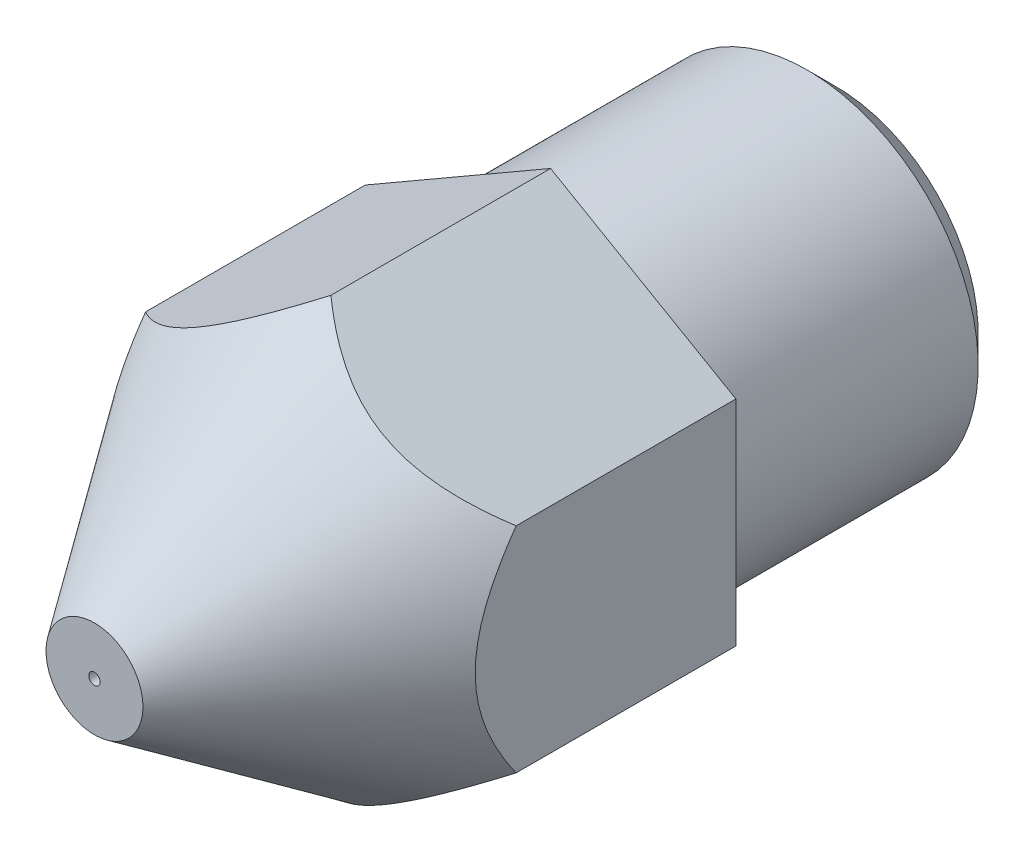
ISO-10303-21;
HEADER;
FILE_DESCRIPTION(('STEP AP214'),'2;1');
FILE_NAME('part.step','',(''),(''),'','','');
FILE_SCHEMA(('AUTOMOTIVE_DESIGN { 1 0 10303 214 1 1 1 1 }'));
ENDSEC;
DATA;
#1=APPLICATION_CONTEXT('core data for automotive mechanical design processes');
#2=APPLICATION_PROTOCOL_DEFINITION('international standard','automotive_design',2000,#1);
#3=PRODUCT_CONTEXT('',#1,'mechanical');
#4=PRODUCT('Part','Part','',(#3));
#5=PRODUCT_RELATED_PRODUCT_CATEGORY('part','',(#4));
#6=PRODUCT_DEFINITION_FORMATION('','',#4);
#7=PRODUCT_DEFINITION_CONTEXT('part definition',#1,'design');
#8=PRODUCT_DEFINITION('design','',#6,#7);
#9=PRODUCT_DEFINITION_SHAPE('','',#8);
#10=(LENGTH_UNIT() NAMED_UNIT(*) SI_UNIT(.MILLI.,.METRE.));
#11=(NAMED_UNIT(*) PLANE_ANGLE_UNIT() SI_UNIT($,.RADIAN.));
#12=(NAMED_UNIT(*) SI_UNIT($,.STERADIAN.) SOLID_ANGLE_UNIT());
#13=UNCERTAINTY_MEASURE_WITH_UNIT(LENGTH_MEASURE(1.E-05),#10,'distance_accuracy_value','');
#14=(GEOMETRIC_REPRESENTATION_CONTEXT(3) GLOBAL_UNCERTAINTY_ASSIGNED_CONTEXT((#13)) GLOBAL_UNIT_ASSIGNED_CONTEXT((#10,
#11,#12)) REPRESENTATION_CONTEXT('',''));
#15=CARTESIAN_POINT('',(0.,0.,0.));
#16=DIRECTION('',(0.,0.,1.));
#17=DIRECTION('',(1.,0.,0.));
#18=AXIS2_PLACEMENT_3D('',#15,#16,#17);
#19=CARTESIAN_POINT('',(-8.72088259015655,0.,-3.5));
#20=DIRECTION('',(0.,0.,-1.));
#21=DIRECTION('',(-1.,0.,0.));
#22=AXIS2_PLACEMENT_3D('',#19,#20,#21);
#23=PLANE('',#22);
#24=CARTESIAN_POINT('',(0.,0.,-3.5));
#25=DIRECTION('',(0.,0.,-1.));
#26=DIRECTION('',(-1.,0.,0.));
#27=AXIS2_PLACEMENT_3D('',#24,#25,#26);
#28=CIRCLE('',#27,3.);
#29=CARTESIAN_POINT('',(-3.,0.,-3.5));
#30=VERTEX_POINT('',#29);
#31=EDGE_CURVE('E173',#30,#30,#28,.T.);
#32=ORIENTED_EDGE('',*,*,#31,.F.);
#33=EDGE_LOOP('',(#32));
#34=FACE_BOUND('',#33,.T.);
#35=DIRECTION('',(0.866025403784438,-0.500000000000001,0.));
#36=VECTOR('',#35,1.);
#37=CARTESIAN_POINT('',(3.25,1.87638837486627,-3.5));
#38=LINE('',#37,#36);
#39=CARTESIAN_POINT('',(0.,3.75277674973256,-3.5));
#40=VERTEX_POINT('',#39);
#41=CARTESIAN_POINT('',(3.25,1.87638837486627,-3.5));
#42=VERTEX_POINT('',#41);
#43=EDGE_CURVE('E115',#40,#42,#38,.T.);
#44=ORIENTED_EDGE('',*,*,#43,.T.);
#45=DIRECTION('',(0.,-1.,0.));
#46=VECTOR('',#45,1.);
#47=CARTESIAN_POINT('',(3.25,1.87638837486627,-3.5));
#48=LINE('',#47,#46);
#49=CARTESIAN_POINT('',(3.25,-1.87638837486629,-3.5));
#50=VERTEX_POINT('',#49);
#51=EDGE_CURVE('E110',#42,#50,#48,.T.);
#52=ORIENTED_EDGE('',*,*,#51,.T.);
#53=DIRECTION('',(-0.866025403784439,-0.499999999999998,0.));
#54=VECTOR('',#53,1.);
#55=CARTESIAN_POINT('',(3.25,-1.87638837486629,-3.5));
#56=LINE('',#55,#54);
#57=CARTESIAN_POINT('',(0.,-3.75277674973256,-3.5));
#58=VERTEX_POINT('',#57);
#59=EDGE_CURVE('E108',#50,#58,#56,.T.);
#60=ORIENTED_EDGE('',*,*,#59,.T.);
#61=DIRECTION('',(-0.866025403784439,0.499999999999998,0.));
#62=VECTOR('',#61,1.);
#63=CARTESIAN_POINT('',(-3.25,-1.87638837486629,-3.5));
#64=LINE('',#63,#62);
#65=CARTESIAN_POINT('',(-3.25,-1.87638837486629,-3.5));
#66=VERTEX_POINT('',#65);
#67=EDGE_CURVE('E57',#58,#66,#64,.T.);
#68=ORIENTED_EDGE('',*,*,#67,.T.);
#69=DIRECTION('',(0.,1.,0.));
#70=VECTOR('',#69,1.);
#71=CARTESIAN_POINT('',(-3.25,1.87638837486627,-3.5));
#72=LINE('',#71,#70);
#73=CARTESIAN_POINT('',(-3.25,1.87638837486627,-3.5));
#74=VERTEX_POINT('',#73);
#75=EDGE_CURVE('E97',#66,#74,#72,.T.);
#76=ORIENTED_EDGE('',*,*,#75,.T.);
#77=DIRECTION('',(0.866025403784438,0.500000000000001,0.));
#78=VECTOR('',#77,1.);
#79=CARTESIAN_POINT('',(-3.25,1.87638837486627,-3.5));
#80=LINE('',#79,#78);
#81=EDGE_CURVE('E103',#74,#40,#80,.T.);
#82=ORIENTED_EDGE('',*,*,#81,.T.);
#83=EDGE_LOOP('',(#44,#52,#60,#68,#76,#82));
#84=FACE_BOUND('',#83,.T.);
#85=ADVANCED_FACE('F34',(#34,#84),#23,.T.);
#86=CARTESIAN_POINT('',(0.,0.,0.));
#87=DIRECTION('',(0.,0.,-1.));
#88=DIRECTION('',(-1.,0.,0.));
#89=AXIS2_PLACEMENT_3D('',#86,#87,#88);
#90=CYLINDRICAL_SURFACE('',#89,3.);
#91=CARTESIAN_POINT('',(0.,0.,-8.));
#92=DIRECTION('',(0.,0.,-1.));
#93=DIRECTION('',(-1.,0.,0.));
#94=AXIS2_PLACEMENT_3D('',#91,#92,#93);
#95=CIRCLE('',#94,3.);
#96=CARTESIAN_POINT('',(-3.,0.,-8.));
#97=VERTEX_POINT('',#96);
#98=EDGE_CURVE('E11',#97,#97,#95,.F.);
#99=ORIENTED_EDGE('',*,*,#98,.T.);
#100=EDGE_LOOP('',(#99));
#101=FACE_BOUND('',#100,.T.);
#102=ORIENTED_EDGE('',*,*,#31,.T.);
#103=EDGE_LOOP('',(#102));
#104=FACE_BOUND('',#103,.T.);
#105=ADVANCED_FACE('F196',(#101,#104),#90,.T.);
#106=CARTESIAN_POINT('',(-8.72088259015655,0.,-8.5));
#107=DIRECTION('',(0.,0.,-1.));
#108=DIRECTION('',(-1.,0.,0.));
#109=AXIS2_PLACEMENT_3D('',#106,#107,#108);
#110=PLANE('',#109);
#111=CARTESIAN_POINT('',(0.,0.,-8.5));
#112=DIRECTION('',(0.,0.,-1.));
#113=DIRECTION('',(-1.,0.,0.));
#114=AXIS2_PLACEMENT_3D('',#111,#112,#113);
#115=CIRCLE('',#114,2.5);
#116=CARTESIAN_POINT('',(-2.5,0.,-8.5));
#117=VERTEX_POINT('',#116);
#118=EDGE_CURVE('E42',#117,#117,#115,.T.);
#119=ORIENTED_EDGE('',*,*,#118,.T.);
#120=EDGE_LOOP('',(#119));
#121=FACE_BOUND('',#120,.T.);
#122=CARTESIAN_POINT('',(0.,0.,-8.5));
#123=DIRECTION('',(0.,0.,-1.));
#124=DIRECTION('',(-1.,0.,0.));
#125=AXIS2_PLACEMENT_3D('',#122,#123,#124);
#126=CIRCLE('',#125,0.999999999999999);
#127=CARTESIAN_POINT('',(-0.999999999999999,0.,-8.5));
#128=VERTEX_POINT('',#127);
#129=EDGE_CURVE('E170',#128,#128,#126,.T.);
#130=ORIENTED_EDGE('',*,*,#129,.F.);
#131=EDGE_LOOP('',(#130));
#132=FACE_BOUND('',#131,.T.);
#133=ADVANCED_FACE('F181',(#121,#132),#110,.T.);
#134=CARTESIAN_POINT('',(0.,0.,0.));
#135=DIRECTION('',(0.,0.,-1.));
#136=DIRECTION('',(-1.,0.,0.));
#137=AXIS2_PLACEMENT_3D('',#134,#135,#136);
#138=CYLINDRICAL_SURFACE('',#137,0.999999999999999);
#139=CARTESIAN_POINT('',(0.,0.,1.7679491924311));
#140=DIRECTION('',(0.,0.,-1.));
#141=DIRECTION('',(-1.,0.,0.));
#142=AXIS2_PLACEMENT_3D('',#139,#140,#141);
#143=CIRCLE('',#142,1.);
#144=CARTESIAN_POINT('',(-1.,0.,1.7679491924311));
#145=VERTEX_POINT('',#144);
#146=EDGE_CURVE('E161',#145,#145,#143,.T.);
#147=ORIENTED_EDGE('',*,*,#146,.F.);
#148=EDGE_LOOP('',(#147));
#149=FACE_BOUND('',#148,.T.);
#150=ORIENTED_EDGE('',*,*,#129,.T.);
#151=EDGE_LOOP('',(#150));
#152=FACE_BOUND('',#151,.T.);
#153=ADVANCED_FACE('F206',(#149,#152),#138,.F.);
#154=CARTESIAN_POINT('',(0.,0.,3.5));
#155=DIRECTION('',(0.,0.,-1.));
#156=DIRECTION('',(-1.,0.,0.));
#157=AXIS2_PLACEMENT_3D('',#154,#155,#156);
#158=CONICAL_SURFACE('',#157,0.,0.523598775598292);
#159=CARTESIAN_POINT('',(0.,0.,3.32679491924311));
#160=DIRECTION('',(0.,0.,-1.));
#161=DIRECTION('',(-1.,0.,0.));
#162=AXIS2_PLACEMENT_3D('',#159,#160,#161);
#163=CIRCLE('',#162,0.1);
#164=CARTESIAN_POINT('',(-0.1,0.,3.32679491924311));
#165=VERTEX_POINT('',#164);
#166=EDGE_CURVE('E221',#165,#165,#163,.T.);
#167=ORIENTED_EDGE('',*,*,#166,.F.);
#168=EDGE_LOOP('',(#167));
#169=FACE_BOUND('',#168,.T.);
#170=ORIENTED_EDGE('',*,*,#146,.T.);
#171=EDGE_LOOP('',(#170));
#172=FACE_BOUND('',#171,.T.);
#173=ADVANCED_FACE('F151',(#169,#172),#158,.F.);
#174=CARTESIAN_POINT('',(3.25,1.87638837486627,6.5));
#175=DIRECTION('',(1.,0.,0.));
#176=DIRECTION('',(0.,0.,-1.));
#177=AXIS2_PLACEMENT_3D('',#174,#175,#176);
#178=PLANE('',#177);
#179=CARTESIAN_POINT('',(3.25,-10.4210247445194,-9.88007856899838));
#180=CARTESIAN_POINT('',(3.25,-10.1550139917363,-9.51733888773863));
#181=CARTESIAN_POINT('',(3.25,-9.88845372005929,-9.15499987226475));
#182=CARTESIAN_POINT('',(3.25,-9.35381845633714,-8.43138045471311));
#183=CARTESIAN_POINT('',(3.25,-9.08574330243901,-8.07010017226316));
#184=CARTESIAN_POINT('',(3.25,-8.5465114504986,-7.34731421528531));
#185=CARTESIAN_POINT('',(3.25,-8.27534631806567,-6.98581482421531));
#186=CARTESIAN_POINT('',(3.25,-7.73055095092707,-6.26472775277727));
#187=CARTESIAN_POINT('',(3.25,-7.45692093696118,-5.90513990572012));
#188=CARTESIAN_POINT('',(3.25,-6.87641455651948,-5.14958529105867));
#189=CARTESIAN_POINT('',(3.25,-6.56915612701844,-4.75391082353562));
#190=CARTESIAN_POINT('',(3.25,-6.10374655484884,-4.16386703706671));
#191=CARTESIAN_POINT('',(3.25,-5.94783218566263,-3.96773403080044));
#192=CARTESIAN_POINT('',(3.25,-5.63415525030047,-3.57695354048657));
#193=CARTESIAN_POINT('',(3.25,-5.4763927096676,-3.3823060359695));
#194=CARTESIAN_POINT('',(3.25,-5.15893896824526,-2.9953516604686));
#195=CARTESIAN_POINT('',(3.25,-4.99925317084272,-2.8030403640479));
#196=CARTESIAN_POINT('',(3.25,-4.67697917481462,-2.42086687340566));
#197=CARTESIAN_POINT('',(3.25,-4.51439105903881,-2.23100460953955));
#198=CARTESIAN_POINT('',(3.25,-4.18553282288161,-1.85464887331366));
#199=CARTESIAN_POINT('',(3.25,-4.01926450825844,-1.66815382690139));
#200=CARTESIAN_POINT('',(3.25,-3.6817798349018,-1.29970882436992));
#201=CARTESIAN_POINT('',(3.25,-3.51056428599971,-1.1177581333577));
#202=CARTESIAN_POINT('',(3.25,-3.26393070137451,-0.865405696541));
#203=CARTESIAN_POINT('',(3.25,-3.19131776621961,-0.79226068358926));
#204=CARTESIAN_POINT('',(3.25,-3.04475880052872,-0.647310082864942));
#205=CARTESIAN_POINT('',(3.25,-2.97081272298776,-0.575504542502851));
#206=CARTESIAN_POINT('',(3.25,-2.82132836383633,-0.433432996749373));
#207=CARTESIAN_POINT('',(3.25,-2.74578873286427,-0.363168408007898));
#208=CARTESIAN_POINT('',(3.25,-2.59294548593326,-0.22458265578279));
#209=CARTESIAN_POINT('',(3.25,-2.51564191392236,-0.156261443975585));
#210=CARTESIAN_POINT('',(3.25,-2.35962863128407,-0.0225418631250678));
#211=CARTESIAN_POINT('',(3.25,-2.28093549668624,0.0428757763280561));
#212=CARTESIAN_POINT('',(3.25,-2.12123029837015,0.170812712160738));
#213=CARTESIAN_POINT('',(3.25,-2.04021848242268,0.233332316363522));
#214=CARTESIAN_POINT('',(3.25,-1.87560781430329,0.354678882841892));
#215=CARTESIAN_POINT('',(3.25,-1.79201214397981,0.413510136233417));
#216=CARTESIAN_POINT('',(3.25,-1.62178865576906,0.526580156933862));
#217=CARTESIAN_POINT('',(3.25,-1.53516194986874,0.580820584007462));
#218=CARTESIAN_POINT('',(3.25,-1.36359261683321,0.680500894316108));
#219=CARTESIAN_POINT('',(3.25,-1.27884180990056,0.726268165597498));
#220=CARTESIAN_POINT('',(3.25,-1.10607956257896,0.811279714200296));
#221=CARTESIAN_POINT('',(3.25,-1.01806782954458,0.850523404333303));
#222=CARTESIAN_POINT('',(3.25,-0.839332144532956,0.920658513948042));
#223=CARTESIAN_POINT('',(3.25,-0.748627228266093,0.951597782491711));
#224=CARTESIAN_POINT('',(3.25,-0.564445767595396,1.00368567339653));
#225=CARTESIAN_POINT('',(3.25,-0.470971158677318,1.02484096884422));
#226=CARTESIAN_POINT('',(3.25,-0.31021269480558,1.05127993409116));
#227=CARTESIAN_POINT('',(3.25,-0.243391087655944,1.05941089272303));
#228=CARTESIAN_POINT('',(3.25,-0.10929692359172,1.06978719391885));
#229=CARTESIAN_POINT('',(3.25,-0.0420244717026198,1.07203386252287));
#230=CARTESIAN_POINT('',(3.25,0.0924859824112476,1.07054346454063));
#231=CARTESIAN_POINT('',(3.25,0.159723951184364,1.06680344045537));
#232=CARTESIAN_POINT('',(3.25,0.293622107986032,1.05349619513517));
#233=CARTESIAN_POINT('',(3.25,0.360282201737024,1.04392804056198));
#234=CARTESIAN_POINT('',(3.25,0.508077283596723,1.01645864781881));
#235=CARTESIAN_POINT('',(3.25,0.588947438494196,0.997130940009136));
#236=CARTESIAN_POINT('',(3.25,0.748591314579006,0.951169900880214));
#237=CARTESIAN_POINT('',(3.25,0.827363941289588,0.924532834472439));
#238=CARTESIAN_POINT('',(3.25,0.982756746605189,0.86498782867529));
#239=CARTESIAN_POINT('',(3.25,1.05936949097002,0.832060694820526));
#240=CARTESIAN_POINT('',(3.25,1.21013939239264,0.761061461579138));
#241=CARTESIAN_POINT('',(3.25,1.28429673132708,0.722989744328012));
#242=CARTESIAN_POINT('',(3.25,1.45103081353316,0.631200477331062));
#243=CARTESIAN_POINT('',(3.25,1.54284959389495,0.576112203216525));
#244=CARTESIAN_POINT('',(3.25,1.72304533999821,0.460540297034056));
#245=CARTESIAN_POINT('',(3.25,1.81142065906605,0.400054128083826));
#246=CARTESIAN_POINT('',(3.25,1.98528352415769,0.274783953130044));
#247=CARTESIAN_POINT('',(3.25,2.07076582073379,0.20999270685187));
#248=CARTESIAN_POINT('',(3.25,2.23911308770666,0.0770901423910738));
#249=CARTESIAN_POINT('',(3.25,2.32197769933942,0.00897837234307475));
#250=CARTESIAN_POINT('',(3.25,2.48653368269928,-0.130809444597796));
#251=CARTESIAN_POINT('',(3.25,2.56819498510862,-0.202520747732826));
#252=CARTESIAN_POINT('',(3.25,2.72953550153858,-0.348137152915524));
#253=CARTESIAN_POINT('',(3.25,2.80921465145204,-0.422042325748644));
#254=CARTESIAN_POINT('',(3.25,2.96677477901546,-0.57155651004705));
#255=CARTESIAN_POINT('',(3.25,3.04465777148272,-0.647163403504268));
#256=CARTESIAN_POINT('',(3.25,3.19894935244089,-0.799857479381094));
#257=CARTESIAN_POINT('',(3.25,3.27535799486935,-0.876944607441244));
#258=CARTESIAN_POINT('',(3.25,3.52045427106936,-1.12827865568185));
#259=CARTESIAN_POINT('',(3.25,3.68661538469058,-1.3049903624906));
#260=CARTESIAN_POINT('',(3.25,4.01427116135899,-1.66270002440727));
#261=CARTESIAN_POINT('',(3.25,4.17576512723189,-1.84369861261292));
#262=CARTESIAN_POINT('',(3.25,4.49525237699607,-2.2088932701784));
#263=CARTESIAN_POINT('',(3.25,4.65324408250668,-2.39309071707174));
#264=CARTESIAN_POINT('',(3.25,4.96645230193129,-2.76383425544363));
#265=CARTESIAN_POINT('',(3.25,5.12166871810462,-2.95038042924734));
#266=CARTESIAN_POINT('',(3.25,5.43025696832106,-3.3257192462737));
#267=CARTESIAN_POINT('',(3.25,5.58362365431564,-3.51451611505904));
#268=CARTESIAN_POINT('',(3.25,5.88857051821366,-3.89354844509705));
#269=CARTESIAN_POINT('',(3.25,6.04015067551032,-4.08378392290193));
#270=CARTESIAN_POINT('',(3.25,6.49263276349124,-4.65609992811039));
#271=CARTESIAN_POINT('',(3.25,6.7913632970303,-5.03989668290531));
#272=CARTESIAN_POINT('',(3.25,7.35168819682291,-5.76754267052628));
#273=CARTESIAN_POINT('',(3.25,7.61370505420361,-6.11106794146315));
#274=CARTESIAN_POINT('',(3.25,8.13537826760183,-6.79994900303737));
#275=CARTESIAN_POINT('',(3.25,8.39503443121531,-7.14530493931204));
#276=CARTESIAN_POINT('',(3.25,8.91140905048834,-7.8358847368182));
#277=CARTESIAN_POINT('',(3.25,9.16813534621361,-8.18110274401208));
#278=CARTESIAN_POINT('',(3.25,9.68012114769552,-8.87257138198324));
#279=CARTESIAN_POINT('',(3.25,9.93538079836424,-9.21882190542288));
#280=CARTESIAN_POINT('',(3.25,10.1901025523241,-9.5654654608227));
#281=B_SPLINE_CURVE_WITH_KNOTS('',3,(#179,#180,#181,#182,#183,#184,#185,#186,#187,#188,#189,
#190,#191,#192,#193,#194,#195,#196,#197,#198,#199,#200,#201,#202,#203,#204,#205,#206,#207,#208,
#209,#210,#211,#212,#213,#214,#215,#216,#217,#218,#219,#220,#221,#222,#223,#224,#225,#226,#227,
#228,#229,#230,#231,#232,#233,#234,#235,#236,#237,#238,#239,#240,#241,#242,#243,#244,#245,#246,
#247,#248,#249,#250,#251,#252,#253,#254,#255,#256,#257,#258,#259,#260,#261,#262,#263,#264,#265,
#266,#267,#268,#269,#270,#271,#272,#273,#274,#275,#276,#277,#278,#279,#280),.UNSPECIFIED.,.F.,
.F.,(4,2,2,2,2,2,2,2,2,2,2,2,2,2,2,2,2,2,2,2,2,2,2,2,2,2,2,2,2,2,2,2,2,2,2,2,2,2,2,2,2,2,2,2,2,
2,2,2,2,2,4),(0.,1.34947476346116,2.6990965413674,4.05478349288121,5.41035022098572,
6.91319924459299,7.66485369747403,8.41649777416657,9.16637554585059,9.91623194560435,
10.6657282314788,11.4151025168822,11.7242903697911,12.0334891456848,12.3429611768772,
12.6524255060691,12.9593698715412,13.2662815589661,13.572829285287,13.8792657048433,
14.1679991521169,14.4567585742705,14.7438166312515,15.0306786126203,15.2323856361125,
15.4340472004895,15.6358084188816,15.8376019565551,16.0866383217799,16.3358021825467,
16.5857388896212,16.8356570417937,17.1566345241216,17.4777636607688,17.7994472548494,
18.1211747473211,18.4471628340489,18.7731614502756,19.0987745945141,19.424375803867,
20.1519280197861,20.8795883608536,21.6075702337514,22.3355776945511,23.0652835436712,
23.7949978013873,25.2540134756318,26.5501364635593,27.8463641592974,29.1370015087049,
30.4275090645206),.UNSPECIFIED.);
#282=CARTESIAN_POINT('',(3.25,1.87638837486627,0.353176071810624));
#283=VERTEX_POINT('',#282);
#284=CARTESIAN_POINT('',(3.25,-1.87638837486629,0.353176071810615));
#285=VERTEX_POINT('',#284);
#286=EDGE_CURVE('E155',#283,#285,#281,.F.);
#287=ORIENTED_EDGE('',*,*,#286,.T.);
#288=DIRECTION('',(0.,0.,-1.));
#289=VECTOR('',#288,1.);
#290=CARTESIAN_POINT('',(3.25,-1.87638837486629,6.5));
#291=LINE('',#290,#289);
#292=EDGE_CURVE('E49',#285,#50,#291,.T.);
#293=ORIENTED_EDGE('',*,*,#292,.T.);
#294=ORIENTED_EDGE('',*,*,#51,.F.);
#295=DIRECTION('',(0.,0.,-1.));
#296=VECTOR('',#295,1.);
#297=CARTESIAN_POINT('',(3.25,1.87638837486627,6.5));
#298=LINE('',#297,#296);
#299=EDGE_CURVE('E117',#283,#42,#298,.T.);
#300=ORIENTED_EDGE('',*,*,#299,.F.);
#301=EDGE_LOOP('',(#287,#293,#294,#300));
#302=FACE_BOUND('',#301,.T.);
#303=ADVANCED_FACE('F146',(#302),#178,.T.);
#304=CARTESIAN_POINT('',(3.25,1.87638837486627,6.5));
#305=DIRECTION('',(0.500000000000001,0.866025403784438,0.));
#306=DIRECTION('',(-0.866025403784438,0.500000000000001,0.));
#307=AXIS2_PLACEMENT_3D('',#304,#305,#306);
#308=PLANE('',#307);
#309=CARTESIAN_POINT('',(-0.00019999999999998,3.7528922197864,0.353011106977677));
#310=CARTESIAN_POINT('',(0.0696924760585749,3.71253977991966,0.410613756754915));
#311=CARTESIAN_POINT('',(0.140732963459875,3.67152453539515,0.466468702287997));
#312=CARTESIAN_POINT('',(0.285650233103082,3.58785651075642,0.573685388217752));
#313=CARTESIAN_POINT('',(0.359536007165287,3.54519853921232,0.625030853673703));
#314=CARTESIAN_POINT('',(0.511798860795695,3.45728953968123,0.722839472228576));
#315=CARTESIAN_POINT('',(0.590237930434609,3.41200272171021,0.769176139046382));
#316=CARTESIAN_POINT('',(0.750144408050631,3.31968067381344,0.853921370951946));
#317=CARTESIAN_POINT('',(0.831607549638905,3.27264790708842,0.892340639215073));
#318=CARTESIAN_POINT('',(1.0278790506324,3.15933050315557,0.971525661471434));
#319=CARTESIAN_POINT('',(1.14404608904675,3.09226143225608,1.00806952115924));
#320=CARTESIAN_POINT('',(1.32043627578567,2.99042251045996,1.04531237413983));
#321=CARTESIAN_POINT('',(1.37932054816664,2.95642565994977,1.05479402211398));
#322=CARTESIAN_POINT('',(1.49759750266951,2.88813842842861,1.06769130783919));
#323=CARTESIAN_POINT('',(1.55699015004808,2.85384806747671,1.07110735685107));
#324=CARTESIAN_POINT('',(1.67596229605911,2.78515946695117,1.07170720821418));
#325=CARTESIAN_POINT('',(1.73554186081175,2.75076118920304,1.06887391054682));
#326=CARTESIAN_POINT('',(1.85423259473233,2.68223506202367,1.05708334674088));
#327=CARTESIAN_POINT('',(1.91334373096993,2.64810723160479,1.04812565385585));
#328=CARTESIAN_POINT('',(2.09046648052649,2.5458453644687,1.01234646240549));
#329=CARTESIAN_POINT('',(2.20718329898305,2.47845887791385,0.976622664700296));
#330=CARTESIAN_POINT('',(2.40539160789344,2.36402325740882,0.898184572275519));
#331=CARTESIAN_POINT('',(2.48820343613702,2.3162118260803,0.859650380228274));
#332=CARTESIAN_POINT('',(2.65072151526336,2.22238196934853,0.774359526769053));
#333=CARTESIAN_POINT('',(2.73042307679968,2.1763662513407,0.727590994350096));
#334=CARTESIAN_POINT('',(2.8850880350143,2.08707039608128,0.628705360068665));
#335=CARTESIAN_POINT('',(2.96011544004436,2.04375330359058,0.576719418243305));
#336=CARTESIAN_POINT('',(3.10721601496487,1.95882474706228,0.46807920989213));
#337=CARTESIAN_POINT('',(3.17929900168905,1.91720761527308,0.411442745491607));
#338=CARTESIAN_POINT('',(3.2502,1.87627290481244,0.35301110697768));
#339=B_SPLINE_CURVE_WITH_KNOTS('',3,(#309,#310,#311,#312,#313,#314,#315,#316,#317,#318,#319,
#320,#321,#322,#323,#324,#325,#326,#327,#328,#329,#330,#331,#332,#333,#334,#335,#336,#337,#338),
.UNSPECIFIED.,.F.,.F.,(4,2,2,2,2,2,2,2,2,2,2,2,2,2,4),(0.,0.297528461773674,0.596090016316984,
0.900977038685541,1.20544915439333,1.62057804961722,1.82630352318148,2.03201504757745,
2.23829015627292,2.4445796396355,2.86086238799738,3.1697665296011,3.4791197036515,
3.78205208298373,4.08387454941209),.UNSPECIFIED.);
#340=CARTESIAN_POINT('',(0.,3.75277674973256,0.353176071810623));
#341=VERTEX_POINT('',#340);
#342=EDGE_CURVE('E162',#341,#283,#339,.T.);
#343=ORIENTED_EDGE('',*,*,#342,.T.);
#344=ORIENTED_EDGE('',*,*,#299,.T.);
#345=ORIENTED_EDGE('',*,*,#43,.F.);
#346=DIRECTION('',(0.,0.,-1.));
#347=VECTOR('',#346,1.);
#348=CARTESIAN_POINT('',(0.,3.75277674973256,6.5));
#349=LINE('',#348,#347);
#350=EDGE_CURVE('E120',#341,#40,#349,.T.);
#351=ORIENTED_EDGE('',*,*,#350,.F.);
#352=EDGE_LOOP('',(#343,#344,#345,#351));
#353=FACE_BOUND('',#352,.T.);
#354=ADVANCED_FACE('F150',(#353),#308,.T.);
#355=CARTESIAN_POINT('',(-3.25,1.87638837486627,6.5));
#356=DIRECTION('',(-0.500000000000001,0.866025403784438,0.));
#357=DIRECTION('',(-0.866025403784438,-0.500000000000001,0.));
#358=AXIS2_PLACEMENT_3D('',#355,#356,#357);
#359=PLANE('',#358);
#360=CARTESIAN_POINT('',(-3.2502,1.87627290481244,0.35301110697768));
#361=CARTESIAN_POINT('',(-3.18030752394143,1.91662534467918,0.410613756754918));
#362=CARTESIAN_POINT('',(-3.10926703654012,1.95764058920369,0.466468702287999));
#363=CARTESIAN_POINT('',(-2.96434976689692,2.04130861384242,0.573685388217755));
#364=CARTESIAN_POINT('',(-2.89046399283471,2.08396658538652,0.625030853673706));
#365=CARTESIAN_POINT('',(-2.73820113920431,2.17187558491761,0.722839472228578));
#366=CARTESIAN_POINT('',(-2.65976206956539,2.21716240288862,0.769176139046383));
#367=CARTESIAN_POINT('',(-2.49985559194937,2.3094844507854,0.853921370951946));
#368=CARTESIAN_POINT('',(-2.41839245036109,2.35651721751042,0.892340639215073));
#369=CARTESIAN_POINT('',(-2.2221209493676,2.46983462144327,0.971525661471434));
#370=CARTESIAN_POINT('',(-2.10595391095325,2.53690369234276,1.00806952115924));
#371=CARTESIAN_POINT('',(-1.92956372421433,2.63874261413888,1.04531237413983));
#372=CARTESIAN_POINT('',(-1.87067945183336,2.67273946464907,1.05479402211398));
#373=CARTESIAN_POINT('',(-1.75240249733049,2.74102669617023,1.06769130783918));
#374=CARTESIAN_POINT('',(-1.69300984995192,2.77531705712213,1.07110735685107));
#375=CARTESIAN_POINT('',(-1.57403770394089,2.84400565764767,1.07170720821418));
#376=CARTESIAN_POINT('',(-1.51445813918825,2.8784039353958,1.06887391054682));
#377=CARTESIAN_POINT('',(-1.39576740526767,2.94693006257517,1.05708334674088));
#378=CARTESIAN_POINT('',(-1.33665626903007,2.98105789299405,1.04812565385586));
#379=CARTESIAN_POINT('',(-1.15953351947351,3.08331976013014,1.01234646240549));
#380=CARTESIAN_POINT('',(-1.04281670101695,3.15070624668499,0.976622664700295));
#381=CARTESIAN_POINT('',(-0.844608392106559,3.26514186719002,0.898184572275517));
#382=CARTESIAN_POINT('',(-0.761796563862977,3.31295329851854,0.859650380228273));
#383=CARTESIAN_POINT('',(-0.599278484736643,3.40678315525031,0.774359526769051));
#384=CARTESIAN_POINT('',(-0.519576923200323,3.45279887325814,0.727590994350094));
#385=CARTESIAN_POINT('',(-0.364911964985697,3.54209472851756,0.628705360068663));
#386=CARTESIAN_POINT('',(-0.289884559955637,3.58541182100826,0.576719418243302));
#387=CARTESIAN_POINT('',(-0.142783985035131,3.67034037753656,0.468079209892127));
#388=CARTESIAN_POINT('',(-0.0707009983109482,3.71195750932576,0.411442745491604));
#389=CARTESIAN_POINT('',(0.000199999999999989,3.7528922197864,0.353011106977678));
#390=B_SPLINE_CURVE_WITH_KNOTS('',3,(#360,#361,#362,#363,#364,#365,#366,#367,#368,#369,#370,
#371,#372,#373,#374,#375,#376,#377,#378,#379,#380,#381,#382,#383,#384,#385,#386,#387,#388,#389),
.UNSPECIFIED.,.F.,.F.,(4,2,2,2,2,2,2,2,2,2,2,2,2,2,4),(0.,0.297528461773675,0.596090016316983,
0.90097703868554,1.20544915439333,1.62057804961722,1.82630352318148,2.03201504757745,
2.23829015627292,2.4445796396355,2.86086238799738,3.16976652960109,3.4791197036515,
3.78205208298373,4.08387454941209),.UNSPECIFIED.);
#391=CARTESIAN_POINT('',(-3.25,1.87638837486627,0.353176071810624));
#392=VERTEX_POINT('',#391);
#393=EDGE_CURVE('E242',#392,#341,#390,.T.);
#394=ORIENTED_EDGE('',*,*,#393,.T.);
#395=ORIENTED_EDGE('',*,*,#350,.T.);
#396=ORIENTED_EDGE('',*,*,#81,.F.);
#397=DIRECTION('',(0.,0.,-1.));
#398=VECTOR('',#397,1.);
#399=CARTESIAN_POINT('',(-3.25,1.87638837486627,6.5));
#400=LINE('',#399,#398);
#401=EDGE_CURVE('E93',#392,#74,#400,.T.);
#402=ORIENTED_EDGE('',*,*,#401,.F.);
#403=EDGE_LOOP('',(#394,#395,#396,#402));
#404=FACE_BOUND('',#403,.T.);
#405=ADVANCED_FACE('F252',(#404),#359,.T.);
#406=CARTESIAN_POINT('',(-3.25,1.87638837486627,6.5));
#407=DIRECTION('',(-1.,0.,0.));
#408=DIRECTION('',(0.,0.,1.));
#409=AXIS2_PLACEMENT_3D('',#406,#407,#408);
#410=PLANE('',#409);
#411=CARTESIAN_POINT('',(-3.25,-10.4210247445194,-9.88007856899838));
#412=CARTESIAN_POINT('',(-3.25,-10.1550139917363,-9.51733888773863));
#413=CARTESIAN_POINT('',(-3.25,-9.88845372005929,-9.15499987226475));
#414=CARTESIAN_POINT('',(-3.25,-9.35381845633714,-8.43138045471311));
#415=CARTESIAN_POINT('',(-3.25,-9.08574330243901,-8.07010017226316));
#416=CARTESIAN_POINT('',(-3.25,-8.5465114504986,-7.34731421528531));
#417=CARTESIAN_POINT('',(-3.25,-8.27534631806567,-6.98581482421531));
#418=CARTESIAN_POINT('',(-3.25,-7.73055095092707,-6.26472775277727));
#419=CARTESIAN_POINT('',(-3.25,-7.45692093696118,-5.90513990572012));
#420=CARTESIAN_POINT('',(-3.25,-6.87641455651948,-5.14958529105867));
#421=CARTESIAN_POINT('',(-3.25,-6.56915612701844,-4.75391082353562));
#422=CARTESIAN_POINT('',(-3.25,-6.10374655484884,-4.16386703706671));
#423=CARTESIAN_POINT('',(-3.25,-5.94783218566263,-3.96773403080044));
#424=CARTESIAN_POINT('',(-3.25,-5.63415525030047,-3.57695354048657));
#425=CARTESIAN_POINT('',(-3.25,-5.4763927096676,-3.3823060359695));
#426=CARTESIAN_POINT('',(-3.25,-5.15893896824526,-2.9953516604686));
#427=CARTESIAN_POINT('',(-3.25,-4.99925317084272,-2.8030403640479));
#428=CARTESIAN_POINT('',(-3.25,-4.67697917481462,-2.42086687340566));
#429=CARTESIAN_POINT('',(-3.25,-4.51439105903881,-2.23100460953955));
#430=CARTESIAN_POINT('',(-3.25,-4.18553282288161,-1.85464887331366));
#431=CARTESIAN_POINT('',(-3.25,-4.01926450825844,-1.66815382690139));
#432=CARTESIAN_POINT('',(-3.25,-3.6817798349018,-1.29970882436992));
#433=CARTESIAN_POINT('',(-3.25,-3.51056428599971,-1.1177581333577));
#434=CARTESIAN_POINT('',(-3.25,-3.26393070137451,-0.865405696541));
#435=CARTESIAN_POINT('',(-3.25,-3.19131776621961,-0.79226068358926));
#436=CARTESIAN_POINT('',(-3.25,-3.04475880052872,-0.647310082864942));
#437=CARTESIAN_POINT('',(-3.25,-2.97081272298776,-0.575504542502851));
#438=CARTESIAN_POINT('',(-3.25,-2.82132836383633,-0.433432996749373));
#439=CARTESIAN_POINT('',(-3.25,-2.74578873286427,-0.363168408007898));
#440=CARTESIAN_POINT('',(-3.25,-2.59294548593326,-0.22458265578279));
#441=CARTESIAN_POINT('',(-3.25,-2.51564191392236,-0.156261443975585));
#442=CARTESIAN_POINT('',(-3.25,-2.35962863128407,-0.0225418631250678));
#443=CARTESIAN_POINT('',(-3.25,-2.28093549668624,0.0428757763280561));
#444=CARTESIAN_POINT('',(-3.25,-2.12123029837015,0.170812712160738));
#445=CARTESIAN_POINT('',(-3.25,-2.04021848242268,0.233332316363522));
#446=CARTESIAN_POINT('',(-3.25,-1.87560781430329,0.354678882841892));
#447=CARTESIAN_POINT('',(-3.25,-1.79201214397981,0.413510136233417));
#448=CARTESIAN_POINT('',(-3.25,-1.62178865576906,0.526580156933862));
#449=CARTESIAN_POINT('',(-3.25,-1.53516194986874,0.580820584007462));
#450=CARTESIAN_POINT('',(-3.25,-1.36359261683321,0.680500894316108));
#451=CARTESIAN_POINT('',(-3.25,-1.27884180990056,0.726268165597498));
#452=CARTESIAN_POINT('',(-3.25,-1.10607956257896,0.811279714200296));
#453=CARTESIAN_POINT('',(-3.25,-1.01806782954458,0.850523404333303));
#454=CARTESIAN_POINT('',(-3.25,-0.839332144532956,0.920658513948042));
#455=CARTESIAN_POINT('',(-3.25,-0.748627228266093,0.951597782491711));
#456=CARTESIAN_POINT('',(-3.25,-0.564445767595396,1.00368567339653));
#457=CARTESIAN_POINT('',(-3.25,-0.470971158677318,1.02484096884422));
#458=CARTESIAN_POINT('',(-3.25,-0.31021269480558,1.05127993409116));
#459=CARTESIAN_POINT('',(-3.25,-0.243391087655944,1.05941089272303));
#460=CARTESIAN_POINT('',(-3.25,-0.10929692359172,1.06978719391885));
#461=CARTESIAN_POINT('',(-3.25,-0.0420244717026198,1.07203386252287));
#462=CARTESIAN_POINT('',(-3.25,0.0924859824112476,1.07054346454063));
#463=CARTESIAN_POINT('',(-3.25,0.159723951184364,1.06680344045537));
#464=CARTESIAN_POINT('',(-3.25,0.293622107986032,1.05349619513517));
#465=CARTESIAN_POINT('',(-3.25,0.360282201737024,1.04392804056198));
#466=CARTESIAN_POINT('',(-3.25,0.508077283596723,1.01645864781881));
#467=CARTESIAN_POINT('',(-3.25,0.588947438494196,0.997130940009136));
#468=CARTESIAN_POINT('',(-3.25,0.748591314579006,0.951169900880214));
#469=CARTESIAN_POINT('',(-3.25,0.827363941289588,0.924532834472439));
#470=CARTESIAN_POINT('',(-3.25,0.982756746605189,0.86498782867529));
#471=CARTESIAN_POINT('',(-3.25,1.05936949097002,0.832060694820526));
#472=CARTESIAN_POINT('',(-3.25,1.21013939239264,0.761061461579138));
#473=CARTESIAN_POINT('',(-3.25,1.28429673132708,0.722989744328012));
#474=CARTESIAN_POINT('',(-3.25,1.45103081353316,0.631200477331062));
#475=CARTESIAN_POINT('',(-3.25,1.54284959389495,0.576112203216525));
#476=CARTESIAN_POINT('',(-3.25,1.72304533999821,0.460540297034056));
#477=CARTESIAN_POINT('',(-3.25,1.81142065906605,0.400054128083826));
#478=CARTESIAN_POINT('',(-3.25,1.98528352415769,0.274783953130044));
#479=CARTESIAN_POINT('',(-3.25,2.07076582073379,0.20999270685187));
#480=CARTESIAN_POINT('',(-3.25,2.23911308770666,0.0770901423910738));
#481=CARTESIAN_POINT('',(-3.25,2.32197769933942,0.00897837234307475));
#482=CARTESIAN_POINT('',(-3.25,2.48653368269928,-0.130809444597796));
#483=CARTESIAN_POINT('',(-3.25,2.56819498510862,-0.202520747732826));
#484=CARTESIAN_POINT('',(-3.25,2.72953550153858,-0.348137152915524));
#485=CARTESIAN_POINT('',(-3.25,2.80921465145204,-0.422042325748644));
#486=CARTESIAN_POINT('',(-3.25,2.96677477901546,-0.57155651004705));
#487=CARTESIAN_POINT('',(-3.25,3.04465777148272,-0.647163403504268));
#488=CARTESIAN_POINT('',(-3.25,3.19894935244089,-0.799857479381094));
#489=CARTESIAN_POINT('',(-3.25,3.27535799486935,-0.876944607441244));
#490=CARTESIAN_POINT('',(-3.25,3.52045427106936,-1.12827865568185));
#491=CARTESIAN_POINT('',(-3.25,3.68661538469058,-1.3049903624906));
#492=CARTESIAN_POINT('',(-3.25,4.01427116135899,-1.66270002440727));
#493=CARTESIAN_POINT('',(-3.25,4.17576512723189,-1.84369861261292));
#494=CARTESIAN_POINT('',(-3.25,4.49525237699607,-2.2088932701784));
#495=CARTESIAN_POINT('',(-3.25,4.65324408250668,-2.39309071707174));
#496=CARTESIAN_POINT('',(-3.25,4.96645230193129,-2.76383425544363));
#497=CARTESIAN_POINT('',(-3.25,5.12166871810462,-2.95038042924734));
#498=CARTESIAN_POINT('',(-3.25,5.43025696832106,-3.3257192462737));
#499=CARTESIAN_POINT('',(-3.25,5.58362365431564,-3.51451611505904));
#500=CARTESIAN_POINT('',(-3.25,5.88857051821366,-3.89354844509705));
#501=CARTESIAN_POINT('',(-3.25,6.04015067551032,-4.08378392290193));
#502=CARTESIAN_POINT('',(-3.25,6.49263276349124,-4.65609992811039));
#503=CARTESIAN_POINT('',(-3.25,6.7913632970303,-5.03989668290531));
#504=CARTESIAN_POINT('',(-3.25,7.35168819682291,-5.76754267052628));
#505=CARTESIAN_POINT('',(-3.25,7.61370505420361,-6.11106794146315));
#506=CARTESIAN_POINT('',(-3.25,8.13537826760183,-6.79994900303737));
#507=CARTESIAN_POINT('',(-3.25,8.39503443121531,-7.14530493931204));
#508=CARTESIAN_POINT('',(-3.25,8.91140905048834,-7.8358847368182));
#509=CARTESIAN_POINT('',(-3.25,9.16813534621361,-8.18110274401208));
#510=CARTESIAN_POINT('',(-3.25,9.68012114769552,-8.87257138198324));
#511=CARTESIAN_POINT('',(-3.25,9.93538079836424,-9.21882190542288));
#512=CARTESIAN_POINT('',(-3.25,10.1901025523241,-9.5654654608227));
#513=B_SPLINE_CURVE_WITH_KNOTS('',3,(#411,#412,#413,#414,#415,#416,#417,#418,#419,#420,#421,
#422,#423,#424,#425,#426,#427,#428,#429,#430,#431,#432,#433,#434,#435,#436,#437,#438,#439,#440,
#441,#442,#443,#444,#445,#446,#447,#448,#449,#450,#451,#452,#453,#454,#455,#456,#457,#458,#459,
#460,#461,#462,#463,#464,#465,#466,#467,#468,#469,#470,#471,#472,#473,#474,#475,#476,#477,#478,
#479,#480,#481,#482,#483,#484,#485,#486,#487,#488,#489,#490,#491,#492,#493,#494,#495,#496,#497,
#498,#499,#500,#501,#502,#503,#504,#505,#506,#507,#508,#509,#510,#511,#512),.UNSPECIFIED.,.F.,
.F.,(4,2,2,2,2,2,2,2,2,2,2,2,2,2,2,2,2,2,2,2,2,2,2,2,2,2,2,2,2,2,2,2,2,2,2,2,2,2,2,2,2,2,2,2,2,
2,2,2,2,2,4),(0.,1.34947476346116,2.6990965413674,4.05478349288121,5.41035022098572,
6.91319924459299,7.66485369747403,8.41649777416657,9.16637554585059,9.91623194560435,
10.6657282314788,11.4151025168822,11.7242903697911,12.0334891456848,12.3429611768772,
12.6524255060691,12.9593698715412,13.2662815589661,13.572829285287,13.8792657048433,
14.1679991521169,14.4567585742705,14.7438166312515,15.0306786126203,15.2323856361125,
15.4340472004895,15.6358084188816,15.8376019565551,16.0866383217799,16.3358021825467,
16.5857388896212,16.8356570417937,17.1566345241216,17.4777636607688,17.7994472548494,
18.1211747473211,18.4471628340489,18.7731614502756,19.0987745945141,19.424375803867,
20.1519280197861,20.8795883608536,21.6075702337514,22.3355776945511,23.0652835436712,
23.7949978013873,25.2540134756318,26.5501364635593,27.8463641592974,29.1370015087049,
30.4275090645206),.UNSPECIFIED.);
#514=CARTESIAN_POINT('',(-3.25,-1.87638837486629,0.353176071810614));
#515=VERTEX_POINT('',#514);
#516=EDGE_CURVE('E243',#515,#392,#513,.T.);
#517=ORIENTED_EDGE('',*,*,#516,.T.);
#518=ORIENTED_EDGE('',*,*,#401,.T.);
#519=ORIENTED_EDGE('',*,*,#75,.F.);
#520=DIRECTION('',(0.,0.,-1.));
#521=VECTOR('',#520,1.);
#522=CARTESIAN_POINT('',(-3.25,-1.87638837486629,6.5));
#523=LINE('',#522,#521);
#524=EDGE_CURVE('E86',#515,#66,#523,.T.);
#525=ORIENTED_EDGE('',*,*,#524,.F.);
#526=EDGE_LOOP('',(#517,#518,#519,#525));
#527=FACE_BOUND('',#526,.T.);
#528=ADVANCED_FACE('F98',(#527),#410,.T.);
#529=CARTESIAN_POINT('',(-3.25,-1.87638837486629,6.5));
#530=DIRECTION('',(-0.499999999999998,-0.866025403784439,0.));
#531=DIRECTION('',(0.86602540378444,-0.499999999999998,0.));
#532=AXIS2_PLACEMENT_3D('',#529,#530,#531);
#533=PLANE('',#532);
#534=CARTESIAN_POINT('',(0.00019999999999996,-3.7528922197864,0.353011106977678));
#535=CARTESIAN_POINT('',(-0.0696924760585751,-3.71253977991966,0.410613756754916));
#536=CARTESIAN_POINT('',(-0.140732963459876,-3.67152453539515,0.466468702287997));
#537=CARTESIAN_POINT('',(-0.285650233103084,-3.58785651075642,0.573685388217752));
#538=CARTESIAN_POINT('',(-0.359536007165289,-3.54519853921232,0.625030853673703));
#539=CARTESIAN_POINT('',(-0.511798860795698,-3.45728953968123,0.722839472228575));
#540=CARTESIAN_POINT('',(-0.590237930434611,-3.41200272171022,0.76917613904638));
#541=CARTESIAN_POINT('',(-0.750144408050634,-3.31968067381344,0.853921370951943));
#542=CARTESIAN_POINT('',(-0.831607549638909,-3.27264790708842,0.892340639215069));
#543=CARTESIAN_POINT('',(-1.0278790506324,-3.15933050315557,0.971525661471428));
#544=CARTESIAN_POINT('',(-1.14404608904676,-3.09226143225608,1.00806952115923));
#545=CARTESIAN_POINT('',(-1.32043627578568,-2.99042251045996,1.04531237413982));
#546=CARTESIAN_POINT('',(-1.37932054816665,-2.95642565994977,1.05479402211397));
#547=CARTESIAN_POINT('',(-1.49759750266951,-2.88813842842861,1.06769130783918));
#548=CARTESIAN_POINT('',(-1.55699015004809,-2.85384806747671,1.07110735685106));
#549=CARTESIAN_POINT('',(-1.67596229605912,-2.78515946695117,1.07170720821418));
#550=CARTESIAN_POINT('',(-1.73554186081175,-2.75076118920304,1.06887391054681));
#551=CARTESIAN_POINT('',(-1.85423259473234,-2.68223506202367,1.05708334674087));
#552=CARTESIAN_POINT('',(-1.91334373096994,-2.64810723160479,1.04812565385584));
#553=CARTESIAN_POINT('',(-2.0904664805265,-2.54584536446871,1.01234646240548));
#554=CARTESIAN_POINT('',(-2.20718329898306,-2.47845887791385,0.976622664700283));
#555=CARTESIAN_POINT('',(-2.40539160789345,-2.36402325740882,0.898184572275505));
#556=CARTESIAN_POINT('',(-2.48820343613703,-2.31621182608031,0.85965038022826));
#557=CARTESIAN_POINT('',(-2.65072151526336,-2.22238196934854,0.774359526769039));
#558=CARTESIAN_POINT('',(-2.73042307679968,-2.17636625134071,0.727590994350083));
#559=CARTESIAN_POINT('',(-2.88508803501431,-2.08707039608129,0.628705360068653));
#560=CARTESIAN_POINT('',(-2.96011544004437,-2.04375330359059,0.576719418243293));
#561=CARTESIAN_POINT('',(-3.10721601496487,-1.95882474706229,0.468079209892119));
#562=CARTESIAN_POINT('',(-3.17929900168905,-1.91720761527309,0.411442745491595));
#563=CARTESIAN_POINT('',(-3.2502,-1.87627290481245,0.35301110697767));
#564=B_SPLINE_CURVE_WITH_KNOTS('',3,(#534,#535,#536,#537,#538,#539,#540,#541,#542,#543,#544,
#545,#546,#547,#548,#549,#550,#551,#552,#553,#554,#555,#556,#557,#558,#559,#560,#561,#562,#563),
.UNSPECIFIED.,.F.,.F.,(4,2,2,2,2,2,2,2,2,2,2,2,2,2,4),(0.,0.297528461773675,0.596090016316984,
0.900977038685541,1.20544915439333,1.62057804961722,1.82630352318148,2.03201504757745,
2.23829015627292,2.4445796396355,2.86086238799738,3.16976652960109,3.4791197036515,
3.78205208298372,4.08387454941208),.UNSPECIFIED.);
#565=CARTESIAN_POINT('',(0.,-3.75277674973256,0.353176071810623));
#566=VERTEX_POINT('',#565);
#567=EDGE_CURVE('E90',#566,#515,#564,.T.);
#568=ORIENTED_EDGE('',*,*,#567,.T.);
#569=ORIENTED_EDGE('',*,*,#524,.T.);
#570=ORIENTED_EDGE('',*,*,#67,.F.);
#571=DIRECTION('',(0.,0.,-1.));
#572=VECTOR('',#571,1.);
#573=CARTESIAN_POINT('',(0.,-3.75277674973256,6.5));
#574=LINE('',#573,#572);
#575=EDGE_CURVE('E94',#566,#58,#574,.T.);
#576=ORIENTED_EDGE('',*,*,#575,.F.);
#577=EDGE_LOOP('',(#568,#569,#570,#576));
#578=FACE_BOUND('',#577,.T.);
#579=ADVANCED_FACE('F88',(#578),#533,.T.);
#580=CARTESIAN_POINT('',(3.25,-1.87638837486629,6.5));
#581=DIRECTION('',(0.499999999999998,-0.866025403784439,0.));
#582=DIRECTION('',(0.86602540378444,0.499999999999998,0.));
#583=AXIS2_PLACEMENT_3D('',#580,#581,#582);
#584=PLANE('',#583);
#585=CARTESIAN_POINT('',(3.2502,-1.87627290481245,0.353011106977671));
#586=CARTESIAN_POINT('',(3.18030752394143,-1.9166253446792,0.410613756754909));
#587=CARTESIAN_POINT('',(3.10926703654012,-1.9576405892037,0.46646870228799));
#588=CARTESIAN_POINT('',(2.96434976689692,-2.04130861384243,0.573685388217745));
#589=CARTESIAN_POINT('',(2.89046399283471,-2.08396658538653,0.625030853673696));
#590=CARTESIAN_POINT('',(2.7382011392043,-2.17187558491763,0.722839472228569));
#591=CARTESIAN_POINT('',(2.65976206956539,-2.21716240288864,0.769176139046374));
#592=CARTESIAN_POINT('',(2.49985559194937,-2.30948445078541,0.853921370951938));
#593=CARTESIAN_POINT('',(2.41839245036109,-2.35651721751044,0.892340639215065));
#594=CARTESIAN_POINT('',(2.2221209493676,-2.46983462144328,0.971525661471425));
#595=CARTESIAN_POINT('',(2.10595391095325,-2.53690369234277,1.00806952115923));
#596=CARTESIAN_POINT('',(1.92956372421432,-2.63874261413889,1.04531237413982));
#597=CARTESIAN_POINT('',(1.87067945183335,-2.67273946464908,1.05479402211397));
#598=CARTESIAN_POINT('',(1.75240249733049,-2.74102669617024,1.06769130783918));
#599=CARTESIAN_POINT('',(1.69300984995191,-2.77531705712214,1.07110735685106));
#600=CARTESIAN_POINT('',(1.57403770394088,-2.84400565764768,1.07170720821417));
#601=CARTESIAN_POINT('',(1.51445813918825,-2.87840393539581,1.06887391054681));
#602=CARTESIAN_POINT('',(1.39576740526766,-2.94693006257518,1.05708334674087));
#603=CARTESIAN_POINT('',(1.33665626903006,-2.98105789299406,1.04812565385585));
#604=CARTESIAN_POINT('',(1.1595335194735,-3.08331976013015,1.01234646240548));
#605=CARTESIAN_POINT('',(1.04281670101694,-3.150706246685,0.976622664700286));
#606=CARTESIAN_POINT('',(0.844608392106551,-3.26514186719003,0.898184572275508));
#607=CARTESIAN_POINT('',(0.76179656386297,-3.31295329851855,0.859650380228264));
#608=CARTESIAN_POINT('',(0.599278484736637,-3.40678315525032,0.774359526769045));
#609=CARTESIAN_POINT('',(0.519576923200317,-3.45279887325814,0.727590994350089));
#610=CARTESIAN_POINT('',(0.364911964985693,-3.54209472851756,0.62870536006866));
#611=CARTESIAN_POINT('',(0.289884559955635,-3.58541182100826,0.5767194182433));
#612=CARTESIAN_POINT('',(0.14278398503513,-3.67034037753656,0.468079209892125));
#613=CARTESIAN_POINT('',(0.070700998310948,-3.71195750932576,0.411442745491602));
#614=CARTESIAN_POINT('',(-0.00020000000000018,-3.7528922197864,0.353011106977678));
#615=B_SPLINE_CURVE_WITH_KNOTS('',3,(#585,#586,#587,#588,#589,#590,#591,#592,#593,#594,#595,
#596,#597,#598,#599,#600,#601,#602,#603,#604,#605,#606,#607,#608,#609,#610,#611,#612,#613,#614),
.UNSPECIFIED.,.F.,.F.,(4,2,2,2,2,2,2,2,2,2,2,2,2,2,4),(0.,0.297528461773675,0.596090016316986,
0.900977038685542,1.20544915439333,1.62057804961723,1.82630352318148,2.03201504757746,
2.23829015627293,2.4445796396355,2.86086238799739,3.1697665296011,3.4791197036515,
3.78205208298372,4.08387454941208),.UNSPECIFIED.);
#616=EDGE_CURVE('E119',#285,#566,#615,.T.);
#617=ORIENTED_EDGE('',*,*,#616,.T.);
#618=ORIENTED_EDGE('',*,*,#575,.T.);
#619=ORIENTED_EDGE('',*,*,#59,.F.);
#620=ORIENTED_EDGE('',*,*,#292,.F.);
#621=EDGE_LOOP('',(#617,#618,#619,#620));
#622=FACE_BOUND('',#621,.T.);
#623=ADVANCED_FACE('F139',(#622),#584,.T.);
#624=CARTESIAN_POINT('',(-8.72088259015655,0.,4.5));
#625=DIRECTION('',(0.,0.,-1.));
#626=DIRECTION('',(-1.,0.,0.));
#627=AXIS2_PLACEMENT_3D('',#624,#625,#626);
#628=PLANE('',#627);
#629=CARTESIAN_POINT('',(0.,0.,4.5));
#630=DIRECTION('',(0.,0.,1.));
#631=DIRECTION('',(1.,0.,0.));
#632=AXIS2_PLACEMENT_3D('',#629,#630,#631);
#633=CIRCLE('',#632,0.1);
#634=CARTESIAN_POINT('',(0.0999999999999997,0.,4.5));
#635=VERTEX_POINT('',#634);
#636=EDGE_CURVE('E222',#635,#635,#633,.T.);
#637=ORIENTED_EDGE('',*,*,#636,.F.);
#638=EDGE_LOOP('',(#637));
#639=FACE_BOUND('',#638,.T.);
#640=CARTESIAN_POINT('',(0.,0.,4.5));
#641=DIRECTION('',(0.,0.,-1.));
#642=DIRECTION('',(-1.,0.,0.));
#643=AXIS2_PLACEMENT_3D('',#640,#641,#642);
#644=CIRCLE('',#643,0.850000000000001);
#645=CARTESIAN_POINT('',(-0.850000000000001,0.,4.5));
#646=VERTEX_POINT('',#645);
#647=EDGE_CURVE('E176',#646,#646,#644,.T.);
#648=ORIENTED_EDGE('',*,*,#647,.F.);
#649=EDGE_LOOP('',(#648));
#650=FACE_BOUND('',#649,.T.);
#651=ADVANCED_FACE('F143',(#639,#650),#628,.F.);
#652=CARTESIAN_POINT('',(0.,0.,4.5));
#653=DIRECTION('',(0.,0.,-1.));
#654=DIRECTION('',(-1.,0.,0.));
#655=AXIS2_PLACEMENT_3D('',#652,#653,#654);
#656=CONICAL_SURFACE('',#655,0.850000000000001,0.610725964389209);
#657=ORIENTED_EDGE('',*,*,#647,.T.);
#658=EDGE_LOOP('',(#657));
#659=FACE_BOUND('',#658,.T.);
#660=ORIENTED_EDGE('',*,*,#286,.F.);
#661=ORIENTED_EDGE('',*,*,#342,.F.);
#662=ORIENTED_EDGE('',*,*,#393,.F.);
#663=ORIENTED_EDGE('',*,*,#516,.F.);
#664=ORIENTED_EDGE('',*,*,#567,.F.);
#665=ORIENTED_EDGE('',*,*,#616,.F.);
#666=EDGE_LOOP('',(#660,#661,#662,#663,#664,#665));
#667=FACE_BOUND('',#666,.T.);
#668=ADVANCED_FACE('F136',(#659,#667),#656,.T.);
#669=CARTESIAN_POINT('',(0.,0.,-8.5));
#670=DIRECTION('',(0.,0.,1.));
#671=DIRECTION('',(1.,0.,0.));
#672=AXIS2_PLACEMENT_3D('',#669,#670,#671);
#673=CONICAL_SURFACE('',#672,2.5,0.785398163397446);
#674=ORIENTED_EDGE('',*,*,#98,.F.);
#675=EDGE_LOOP('',(#674));
#676=FACE_BOUND('',#675,.T.);
#677=ORIENTED_EDGE('',*,*,#118,.F.);
#678=EDGE_LOOP('',(#677));
#679=FACE_BOUND('',#678,.T.);
#680=ADVANCED_FACE('F36',(#676,#679),#673,.T.);
#681=CARTESIAN_POINT('',(0.,0.,-8.5));
#682=DIRECTION('',(0.,0.,1.));
#683=DIRECTION('',(1.,0.,0.));
#684=AXIS2_PLACEMENT_3D('',#681,#682,#683);
#685=CYLINDRICAL_SURFACE('',#684,0.1);
#686=ORIENTED_EDGE('',*,*,#166,.T.);
#687=EDGE_LOOP('',(#686));
#688=FACE_BOUND('',#687,.T.);
#689=ORIENTED_EDGE('',*,*,#636,.T.);
#690=EDGE_LOOP('',(#689));
#691=FACE_BOUND('',#690,.T.);
#692=ADVANCED_FACE('F185',(#688,#691),#685,.F.);
#693=CLOSED_SHELL('',(#85,#105,#133,#153,#173,#303,#354,#405,#528,#579,#623,#651,#668,#680,#692));
#694=MANIFOLD_SOLID_BREP('B2',#693);
#695=ADVANCED_BREP_SHAPE_REPRESENTATION('',(#18,#694),#14);
#696=SHAPE_DEFINITION_REPRESENTATION(#9,#695);
ENDSEC;
END-ISO-10303-21;
